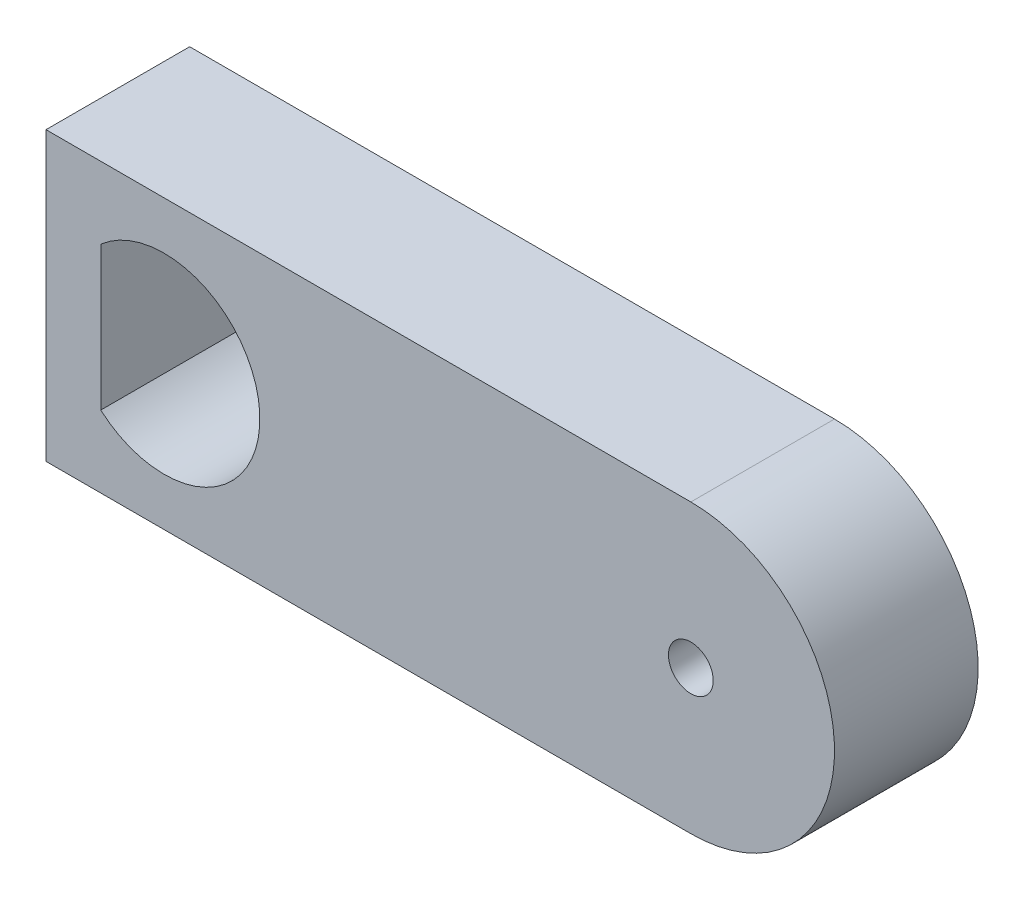
ISO-10303-21;
HEADER;
FILE_DESCRIPTION(('STEP AP214'),'2;1');
FILE_NAME('part.step','',(''),(''),'','','');
FILE_SCHEMA(('AUTOMOTIVE_DESIGN { 1 0 10303 214 1 1 1 1 }'));
ENDSEC;
DATA;
#1=APPLICATION_CONTEXT('core data for automotive mechanical design processes');
#2=APPLICATION_PROTOCOL_DEFINITION('international standard','automotive_design',2000,#1);
#3=PRODUCT_CONTEXT('',#1,'mechanical');
#4=PRODUCT('Part','Part','',(#3));
#5=PRODUCT_RELATED_PRODUCT_CATEGORY('part','',(#4));
#6=PRODUCT_DEFINITION_FORMATION('','',#4);
#7=PRODUCT_DEFINITION_CONTEXT('part definition',#1,'design');
#8=PRODUCT_DEFINITION('design','',#6,#7);
#9=PRODUCT_DEFINITION_SHAPE('','',#8);
#10=(LENGTH_UNIT() NAMED_UNIT(*) SI_UNIT(.MILLI.,.METRE.));
#11=(NAMED_UNIT(*) PLANE_ANGLE_UNIT() SI_UNIT($,.RADIAN.));
#12=(NAMED_UNIT(*) SI_UNIT($,.STERADIAN.) SOLID_ANGLE_UNIT());
#13=UNCERTAINTY_MEASURE_WITH_UNIT(LENGTH_MEASURE(1.E-05),#10,'distance_accuracy_value','');
#14=(GEOMETRIC_REPRESENTATION_CONTEXT(3) GLOBAL_UNCERTAINTY_ASSIGNED_CONTEXT((#13)) GLOBAL_UNIT_ASSIGNED_CONTEXT((#10,
#11,#12)) REPRESENTATION_CONTEXT('',''));
#15=CARTESIAN_POINT('',(0.,0.,0.));
#16=DIRECTION('',(0.,0.,1.));
#17=DIRECTION('',(1.,0.,0.));
#18=AXIS2_PLACEMENT_3D('',#15,#16,#17);
#19=CARTESIAN_POINT('',(6.32099292939342,0.,3.));
#20=DIRECTION('',(0.,0.,1.));
#21=DIRECTION('',(1.,0.,0.));
#22=AXIS2_PLACEMENT_3D('',#19,#20,#21);
#23=PLANE('',#22);
#24=DIRECTION('',(0.,-1.,0.));
#25=VECTOR('',#24,1.);
#26=CARTESIAN_POINT('',(-7.14534270922205,-3.,3.));
#27=LINE('',#26,#25);
#28=CARTESIAN_POINT('',(-7.14534270922205,3.,3.));
#29=VERTEX_POINT('',#28);
#30=CARTESIAN_POINT('',(-7.14534270922205,-3.,3.));
#31=VERTEX_POINT('',#30);
#32=EDGE_CURVE('E129',#29,#31,#27,.T.);
#33=ORIENTED_EDGE('',*,*,#32,.T.);
#34=DIRECTION('',(1.,0.,0.));
#35=VECTOR('',#34,1.);
#36=CARTESIAN_POINT('',(-7.14534270922205,-3.,3.));
#37=LINE('',#36,#35);
#38=CARTESIAN_POINT('',(6.32099292939342,-3.,3.));
#39=VERTEX_POINT('',#38);
#40=EDGE_CURVE('E133',#31,#39,#37,.T.);
#41=ORIENTED_EDGE('',*,*,#40,.T.);
#42=CARTESIAN_POINT('',(6.32099292939342,0.,3.));
#43=DIRECTION('',(0.,0.,1.));
#44=DIRECTION('',(1.,0.,0.));
#45=AXIS2_PLACEMENT_3D('',#42,#43,#44);
#46=CIRCLE('',#45,3.);
#47=CARTESIAN_POINT('',(6.32099292939342,3.,3.));
#48=VERTEX_POINT('',#47);
#49=EDGE_CURVE('E137',#39,#48,#46,.T.);
#50=ORIENTED_EDGE('',*,*,#49,.T.);
#51=DIRECTION('',(-1.,0.,0.));
#52=VECTOR('',#51,1.);
#53=CARTESIAN_POINT('',(-7.14534270922205,3.,3.));
#54=LINE('',#53,#52);
#55=EDGE_CURVE('E140',#48,#29,#54,.T.);
#56=ORIENTED_EDGE('',*,*,#55,.T.);
#57=EDGE_LOOP('',(#33,#41,#50,#56));
#58=FACE_BOUND('',#57,.T.);
#59=CARTESIAN_POINT('',(6.32099292939342,0.,3.));
#60=DIRECTION('',(0.,0.,1.));
#61=DIRECTION('',(1.,0.,0.));
#62=AXIS2_PLACEMENT_3D('',#59,#60,#61);
#63=CIRCLE('',#62,0.467713672759203);
#64=CARTESIAN_POINT('',(6.78870660215263,0.,3.));
#65=VERTEX_POINT('',#64);
#66=EDGE_CURVE('E121',#65,#65,#63,.T.);
#67=ORIENTED_EDGE('',*,*,#66,.F.);
#68=EDGE_LOOP('',(#67));
#69=FACE_BOUND('',#68,.T.);
#70=DIRECTION('',(0.,-1.,0.));
#71=VECTOR('',#70,1.);
#72=CARTESIAN_POINT('',(-6.00188272613888,1.49999999999999,3.));
#73=LINE('',#72,#71);
#74=CARTESIAN_POINT('',(-6.00188272613888,1.49999999999999,3.));
#75=VERTEX_POINT('',#74);
#76=CARTESIAN_POINT('',(-6.00188272613886,-1.50000000000001,3.));
#77=VERTEX_POINT('',#76);
#78=EDGE_CURVE('E98',#75,#77,#73,.T.);
#79=ORIENTED_EDGE('',*,*,#78,.F.);
#80=CARTESIAN_POINT('',(-4.67900707060658,0.,3.));
#81=DIRECTION('',(0.,0.,1.));
#82=DIRECTION('',(1.,0.,0.));
#83=AXIS2_PLACEMENT_3D('',#80,#81,#82);
#84=CIRCLE('',#83,2.);
#85=EDGE_CURVE('E105',#77,#75,#84,.T.);
#86=ORIENTED_EDGE('',*,*,#85,.F.);
#87=EDGE_LOOP('',(#79,#86));
#88=FACE_BOUND('',#87,.T.);
#89=ADVANCED_FACE('F45',(#58,#69,#88),#23,.T.);
#90=CARTESIAN_POINT('',(6.32099292939342,0.,0.));
#91=DIRECTION('',(0.,0.,1.));
#92=DIRECTION('',(1.,0.,0.));
#93=AXIS2_PLACEMENT_3D('',#90,#91,#92);
#94=PLANE('',#93);
#95=CARTESIAN_POINT('',(6.32099292939342,0.,0.));
#96=DIRECTION('',(0.,0.,1.));
#97=DIRECTION('',(1.,0.,0.));
#98=AXIS2_PLACEMENT_3D('',#95,#96,#97);
#99=CIRCLE('',#98,0.467713672759203);
#100=CARTESIAN_POINT('',(6.78870660215263,0.,0.));
#101=VERTEX_POINT('',#100);
#102=EDGE_CURVE('E120',#101,#101,#99,.T.);
#103=ORIENTED_EDGE('',*,*,#102,.T.);
#104=EDGE_LOOP('',(#103));
#105=FACE_BOUND('',#104,.T.);
#106=DIRECTION('',(0.,-1.,0.));
#107=VECTOR('',#106,1.);
#108=CARTESIAN_POINT('',(-7.14534270922205,-3.,0.));
#109=LINE('',#108,#107);
#110=CARTESIAN_POINT('',(-7.14534270922205,3.,0.));
#111=VERTEX_POINT('',#110);
#112=CARTESIAN_POINT('',(-7.14534270922205,-3.,0.));
#113=VERTEX_POINT('',#112);
#114=EDGE_CURVE('E125',#111,#113,#109,.T.);
#115=ORIENTED_EDGE('',*,*,#114,.F.);
#116=DIRECTION('',(-1.,0.,0.));
#117=VECTOR('',#116,1.);
#118=CARTESIAN_POINT('',(-7.14534270922205,3.,0.));
#119=LINE('',#118,#117);
#120=CARTESIAN_POINT('',(6.32099292939342,3.,0.));
#121=VERTEX_POINT('',#120);
#122=EDGE_CURVE('E134',#121,#111,#119,.T.);
#123=ORIENTED_EDGE('',*,*,#122,.F.);
#124=CARTESIAN_POINT('',(6.32099292939342,0.,0.));
#125=DIRECTION('',(0.,0.,1.));
#126=DIRECTION('',(1.,0.,0.));
#127=AXIS2_PLACEMENT_3D('',#124,#125,#126);
#128=CIRCLE('',#127,3.);
#129=CARTESIAN_POINT('',(6.32099292939342,-3.,0.));
#130=VERTEX_POINT('',#129);
#131=EDGE_CURVE('E150',#130,#121,#128,.T.);
#132=ORIENTED_EDGE('',*,*,#131,.F.);
#133=DIRECTION('',(1.,0.,0.));
#134=VECTOR('',#133,1.);
#135=CARTESIAN_POINT('',(-7.14534270922205,-3.,0.));
#136=LINE('',#135,#134);
#137=EDGE_CURVE('E147',#113,#130,#136,.T.);
#138=ORIENTED_EDGE('',*,*,#137,.F.);
#139=EDGE_LOOP('',(#115,#123,#132,#138));
#140=FACE_BOUND('',#139,.T.);
#141=CARTESIAN_POINT('',(-4.67900707060658,0.,0.));
#142=DIRECTION('',(0.,0.,1.));
#143=DIRECTION('',(1.,0.,0.));
#144=AXIS2_PLACEMENT_3D('',#141,#142,#143);
#145=CIRCLE('',#144,2.);
#146=CARTESIAN_POINT('',(-6.00188272613886,-1.50000000000001,0.));
#147=VERTEX_POINT('',#146);
#148=CARTESIAN_POINT('',(-6.00188272613888,1.49999999999999,0.));
#149=VERTEX_POINT('',#148);
#150=EDGE_CURVE('E68',#147,#149,#145,.T.);
#151=ORIENTED_EDGE('',*,*,#150,.T.);
#152=DIRECTION('',(0.,-1.,0.));
#153=VECTOR('',#152,1.);
#154=CARTESIAN_POINT('',(-6.00188272613888,1.49999999999999,0.));
#155=LINE('',#154,#153);
#156=EDGE_CURVE('E111',#149,#147,#155,.T.);
#157=ORIENTED_EDGE('',*,*,#156,.T.);
#158=EDGE_LOOP('',(#151,#157));
#159=FACE_BOUND('',#158,.T.);
#160=ADVANCED_FACE('F173',(#105,#140,#159),#94,.F.);
#161=CARTESIAN_POINT('',(-7.14534270922205,-3.,3.));
#162=DIRECTION('',(1.,0.,0.));
#163=DIRECTION('',(0.,0.,-1.));
#164=AXIS2_PLACEMENT_3D('',#161,#162,#163);
#165=PLANE('',#164);
#166=ORIENTED_EDGE('',*,*,#114,.T.);
#167=DIRECTION('',(0.,0.,-1.));
#168=VECTOR('',#167,1.);
#169=CARTESIAN_POINT('',(-7.14534270922205,-3.,3.));
#170=LINE('',#169,#168);
#171=EDGE_CURVE('E11',#31,#113,#170,.T.);
#172=ORIENTED_EDGE('',*,*,#171,.F.);
#173=ORIENTED_EDGE('',*,*,#32,.F.);
#174=DIRECTION('',(0.,0.,-1.));
#175=VECTOR('',#174,1.);
#176=CARTESIAN_POINT('',(-7.14534270922205,3.,3.));
#177=LINE('',#176,#175);
#178=EDGE_CURVE('E143',#29,#111,#177,.T.);
#179=ORIENTED_EDGE('',*,*,#178,.T.);
#180=EDGE_LOOP('',(#166,#172,#173,#179));
#181=FACE_BOUND('',#180,.T.);
#182=ADVANCED_FACE('F47',(#181),#165,.F.);
#183=CARTESIAN_POINT('',(-7.14534270922205,-3.,3.));
#184=DIRECTION('',(0.,1.,0.));
#185=DIRECTION('',(0.,0.,1.));
#186=AXIS2_PLACEMENT_3D('',#183,#184,#185);
#187=PLANE('',#186);
#188=ORIENTED_EDGE('',*,*,#137,.T.);
#189=DIRECTION('',(0.,0.,-1.));
#190=VECTOR('',#189,1.);
#191=CARTESIAN_POINT('',(6.32099292939342,-3.,3.));
#192=LINE('',#191,#190);
#193=EDGE_CURVE('E54',#39,#130,#192,.T.);
#194=ORIENTED_EDGE('',*,*,#193,.F.);
#195=ORIENTED_EDGE('',*,*,#40,.F.);
#196=ORIENTED_EDGE('',*,*,#171,.T.);
#197=EDGE_LOOP('',(#188,#194,#195,#196));
#198=FACE_BOUND('',#197,.T.);
#199=ADVANCED_FACE('F184',(#198),#187,.F.);
#200=CARTESIAN_POINT('',(6.32099292939342,0.,3.));
#201=DIRECTION('',(0.,0.,-1.));
#202=DIRECTION('',(-1.,0.,0.));
#203=AXIS2_PLACEMENT_3D('',#200,#201,#202);
#204=CYLINDRICAL_SURFACE('',#203,3.);
#205=ORIENTED_EDGE('',*,*,#131,.T.);
#206=DIRECTION('',(0.,0.,-1.));
#207=VECTOR('',#206,1.);
#208=CARTESIAN_POINT('',(6.32099292939342,3.,3.));
#209=LINE('',#208,#207);
#210=EDGE_CURVE('E158',#48,#121,#209,.T.);
#211=ORIENTED_EDGE('',*,*,#210,.F.);
#212=ORIENTED_EDGE('',*,*,#49,.F.);
#213=ORIENTED_EDGE('',*,*,#193,.T.);
#214=EDGE_LOOP('',(#205,#211,#212,#213));
#215=FACE_BOUND('',#214,.T.);
#216=ADVANCED_FACE('F167',(#215),#204,.T.);
#217=CARTESIAN_POINT('',(-7.14534270922205,3.,3.));
#218=DIRECTION('',(0.,-1.,0.));
#219=DIRECTION('',(0.,0.,-1.));
#220=AXIS2_PLACEMENT_3D('',#217,#218,#219);
#221=PLANE('',#220);
#222=ORIENTED_EDGE('',*,*,#122,.T.);
#223=ORIENTED_EDGE('',*,*,#178,.F.);
#224=ORIENTED_EDGE('',*,*,#55,.F.);
#225=ORIENTED_EDGE('',*,*,#210,.T.);
#226=EDGE_LOOP('',(#222,#223,#224,#225));
#227=FACE_BOUND('',#226,.T.);
#228=ADVANCED_FACE('F177',(#227),#221,.F.);
#229=CARTESIAN_POINT('',(6.32099292939342,0.,3.));
#230=DIRECTION('',(0.,0.,-1.));
#231=DIRECTION('',(-1.,0.,0.));
#232=AXIS2_PLACEMENT_3D('',#229,#230,#231);
#233=CYLINDRICAL_SURFACE('',#232,0.467713672759203);
#234=ORIENTED_EDGE('',*,*,#66,.T.);
#235=EDGE_LOOP('',(#234));
#236=FACE_BOUND('',#235,.T.);
#237=ORIENTED_EDGE('',*,*,#102,.F.);
#238=EDGE_LOOP('',(#237));
#239=FACE_BOUND('',#238,.T.);
#240=ADVANCED_FACE('F199',(#236,#239),#233,.F.);
#241=CARTESIAN_POINT('',(-4.67900707060658,0.,3.));
#242=DIRECTION('',(0.,0.,-1.));
#243=DIRECTION('',(-1.,0.,0.));
#244=AXIS2_PLACEMENT_3D('',#241,#242,#243);
#245=CYLINDRICAL_SURFACE('',#244,2.);
#246=ORIENTED_EDGE('',*,*,#150,.F.);
#247=DIRECTION('',(0.,0.,-1.));
#248=VECTOR('',#247,1.);
#249=CARTESIAN_POINT('',(-6.00188272613886,-1.50000000000001,3.));
#250=LINE('',#249,#248);
#251=EDGE_CURVE('E100',#77,#147,#250,.T.);
#252=ORIENTED_EDGE('',*,*,#251,.F.);
#253=ORIENTED_EDGE('',*,*,#85,.T.);
#254=DIRECTION('',(0.,0.,-1.));
#255=VECTOR('',#254,1.);
#256=CARTESIAN_POINT('',(-6.00188272613888,1.49999999999999,3.));
#257=LINE('',#256,#255);
#258=EDGE_CURVE('E61',#75,#149,#257,.T.);
#259=ORIENTED_EDGE('',*,*,#258,.T.);
#260=EDGE_LOOP('',(#246,#252,#253,#259));
#261=FACE_BOUND('',#260,.T.);
#262=ADVANCED_FACE('F107',(#261),#245,.F.);
#263=CARTESIAN_POINT('',(-6.00188272613888,1.49999999999999,3.));
#264=DIRECTION('',(1.,0.,0.));
#265=DIRECTION('',(0.,1.,0.));
#266=AXIS2_PLACEMENT_3D('',#263,#264,#265);
#267=PLANE('',#266);
#268=ORIENTED_EDGE('',*,*,#156,.F.);
#269=ORIENTED_EDGE('',*,*,#258,.F.);
#270=ORIENTED_EDGE('',*,*,#78,.T.);
#271=ORIENTED_EDGE('',*,*,#251,.T.);
#272=EDGE_LOOP('',(#268,#269,#270,#271));
#273=FACE_BOUND('',#272,.T.);
#274=ADVANCED_FACE('F99',(#273),#267,.T.);
#275=CLOSED_SHELL('',(#89,#160,#182,#199,#216,#228,#240,#262,#274));
#276=MANIFOLD_SOLID_BREP('B2',#275);
#277=ADVANCED_BREP_SHAPE_REPRESENTATION('',(#18,#276),#14);
#278=SHAPE_DEFINITION_REPRESENTATION(#9,#277);
ENDSEC;
END-ISO-10303-21;
